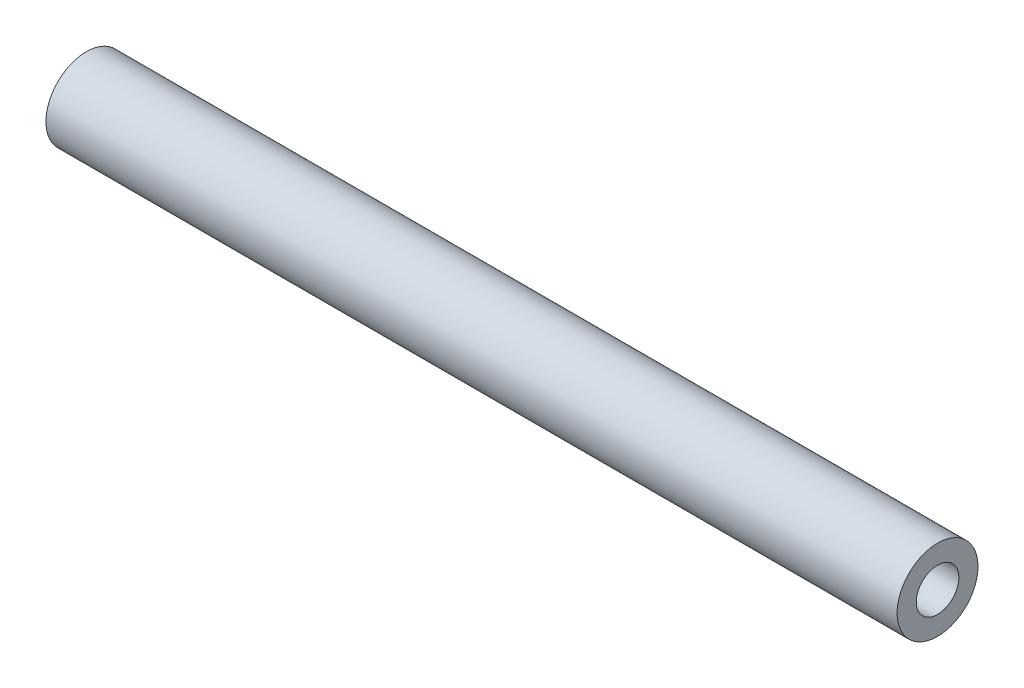
ISO-10303-21;
HEADER;
FILE_DESCRIPTION(('STEP AP214'),'2;1');
FILE_NAME('part.step','',(''),(''),'','','');
FILE_SCHEMA(('AUTOMOTIVE_DESIGN { 1 0 10303 214 1 1 1 1 }'));
ENDSEC;
DATA;
#1=APPLICATION_CONTEXT('core data for automotive mechanical design processes');
#2=APPLICATION_PROTOCOL_DEFINITION('international standard','automotive_design',2000,#1);
#3=PRODUCT_CONTEXT('',#1,'mechanical');
#4=PRODUCT('Part','Part','',(#3));
#5=PRODUCT_RELATED_PRODUCT_CATEGORY('part','',(#4));
#6=PRODUCT_DEFINITION_FORMATION('','',#4);
#7=PRODUCT_DEFINITION_CONTEXT('part definition',#1,'design');
#8=PRODUCT_DEFINITION('design','',#6,#7);
#9=PRODUCT_DEFINITION_SHAPE('','',#8);
#10=(LENGTH_UNIT() NAMED_UNIT(*) SI_UNIT(.MILLI.,.METRE.));
#11=(NAMED_UNIT(*) PLANE_ANGLE_UNIT() SI_UNIT($,.RADIAN.));
#12=(NAMED_UNIT(*) SI_UNIT($,.STERADIAN.) SOLID_ANGLE_UNIT());
#13=UNCERTAINTY_MEASURE_WITH_UNIT(LENGTH_MEASURE(1.E-05),#10,'distance_accuracy_value','');
#14=(GEOMETRIC_REPRESENTATION_CONTEXT(3) GLOBAL_UNCERTAINTY_ASSIGNED_CONTEXT((#13)) GLOBAL_UNIT_ASSIGNED_CONTEXT((#10,
#11,#12)) REPRESENTATION_CONTEXT('',''));
#15=CARTESIAN_POINT('',(0.,0.,0.));
#16=DIRECTION('',(0.,0.,1.));
#17=DIRECTION('',(1.,0.,0.));
#18=AXIS2_PLACEMENT_3D('',#15,#16,#17);
#19=CARTESIAN_POINT('',(168.402,0.,0.));
#20=DIRECTION('',(-1.,0.,0.));
#21=DIRECTION('',(0.,0.,1.));
#22=AXIS2_PLACEMENT_3D('',#19,#20,#21);
#23=CYLINDRICAL_SURFACE('',#22,8.00099999999999);
#24=CARTESIAN_POINT('',(168.402,0.,0.));
#25=DIRECTION('',(1.,0.,0.));
#26=DIRECTION('',(0.,0.,-1.));
#27=AXIS2_PLACEMENT_3D('',#24,#25,#26);
#28=CIRCLE('',#27,8.00099999999999);
#29=CARTESIAN_POINT('',(168.402,0.,-8.00099999999999));
#30=VERTEX_POINT('',#29);
#31=EDGE_CURVE('E11',#30,#30,#28,.T.);
#32=ORIENTED_EDGE('',*,*,#31,.F.);
#33=EDGE_LOOP('',(#32));
#34=FACE_BOUND('',#33,.T.);
#35=CARTESIAN_POINT('',(0.,0.,0.));
#36=DIRECTION('',(1.,0.,0.));
#37=DIRECTION('',(0.,0.,-1.));
#38=AXIS2_PLACEMENT_3D('',#35,#36,#37);
#39=CIRCLE('',#38,8.00099999999999);
#40=CARTESIAN_POINT('',(0.,0.,-8.00099999999999));
#41=VERTEX_POINT('',#40);
#42=EDGE_CURVE('E39',#41,#41,#39,.T.);
#43=ORIENTED_EDGE('',*,*,#42,.T.);
#44=EDGE_LOOP('',(#43));
#45=FACE_BOUND('',#44,.T.);
#46=ADVANCED_FACE('F36',(#34,#45),#23,.T.);
#47=CARTESIAN_POINT('',(168.402,0.,0.));
#48=DIRECTION('',(1.,0.,0.));
#49=DIRECTION('',(0.,0.,-1.));
#50=AXIS2_PLACEMENT_3D('',#47,#48,#49);
#51=PLANE('',#50);
#52=CARTESIAN_POINT('',(168.402,0.,0.));
#53=DIRECTION('',(1.,0.,0.));
#54=DIRECTION('',(0.,0.,-1.));
#55=AXIS2_PLACEMENT_3D('',#52,#53,#54);
#56=CIRCLE('',#55,4.2164);
#57=CARTESIAN_POINT('',(168.402,0.,-4.2164));
#58=VERTEX_POINT('',#57);
#59=EDGE_CURVE('E55',#58,#58,#56,.T.);
#60=ORIENTED_EDGE('',*,*,#59,.F.);
#61=EDGE_LOOP('',(#60));
#62=FACE_BOUND('',#61,.T.);
#63=ORIENTED_EDGE('',*,*,#31,.T.);
#64=EDGE_LOOP('',(#63));
#65=FACE_BOUND('',#64,.T.);
#66=ADVANCED_FACE('F63',(#62,#65),#51,.T.);
#67=CARTESIAN_POINT('',(0.,0.,0.));
#68=DIRECTION('',(1.,0.,0.));
#69=DIRECTION('',(0.,0.,-1.));
#70=AXIS2_PLACEMENT_3D('',#67,#68,#69);
#71=PLANE('',#70);
#72=ORIENTED_EDGE('',*,*,#42,.F.);
#73=EDGE_LOOP('',(#72));
#74=FACE_BOUND('',#73,.T.);
#75=ADVANCED_FACE('F49',(#74),#71,.F.);
#76=CARTESIAN_POINT('',(146.05,0.,0.));
#77=DIRECTION('',(1.,0.,0.));
#78=DIRECTION('',(0.,0.,-1.));
#79=AXIS2_PLACEMENT_3D('',#76,#77,#78);
#80=CONICAL_SURFACE('',#79,4.2164,1.02974425867666);
#81=CARTESIAN_POINT('',(143.516531285932,0.,0.));
#82=VERTEX_POINT('',#81);
#83=VERTEX_LOOP('',#82);
#84=FACE_BOUND('',#83,.T.);
#85=CARTESIAN_POINT('',(146.05,0.,0.));
#86=DIRECTION('',(1.,0.,0.));
#87=DIRECTION('',(0.,0.,-1.));
#88=AXIS2_PLACEMENT_3D('',#85,#86,#87);
#89=CIRCLE('',#88,4.2164);
#90=CARTESIAN_POINT('',(146.05,0.,-4.2164));
#91=VERTEX_POINT('',#90);
#92=EDGE_CURVE('E53',#91,#91,#89,.T.);
#93=ORIENTED_EDGE('',*,*,#92,.T.);
#94=EDGE_LOOP('',(#93));
#95=FACE_BOUND('',#94,.T.);
#96=ADVANCED_FACE('F45',(#84,#95),#80,.F.);
#97=CARTESIAN_POINT('',(168.402,0.,0.));
#98=DIRECTION('',(1.,0.,0.));
#99=DIRECTION('',(0.,0.,-1.));
#100=AXIS2_PLACEMENT_3D('',#97,#98,#99);
#101=CYLINDRICAL_SURFACE('',#100,4.2164);
#102=ORIENTED_EDGE('',*,*,#92,.F.);
#103=EDGE_LOOP('',(#102));
#104=FACE_BOUND('',#103,.T.);
#105=ORIENTED_EDGE('',*,*,#59,.T.);
#106=EDGE_LOOP('',(#105));
#107=FACE_BOUND('',#106,.T.);
#108=ADVANCED_FACE('F48',(#104,#107),#101,.F.);
#109=CLOSED_SHELL('',(#46,#66,#75,#96,#108));
#110=MANIFOLD_SOLID_BREP('B2',#109);
#111=ADVANCED_BREP_SHAPE_REPRESENTATION('',(#18,#110),#14);
#112=SHAPE_DEFINITION_REPRESENTATION(#9,#111);
ENDSEC;
END-ISO-10303-21;
